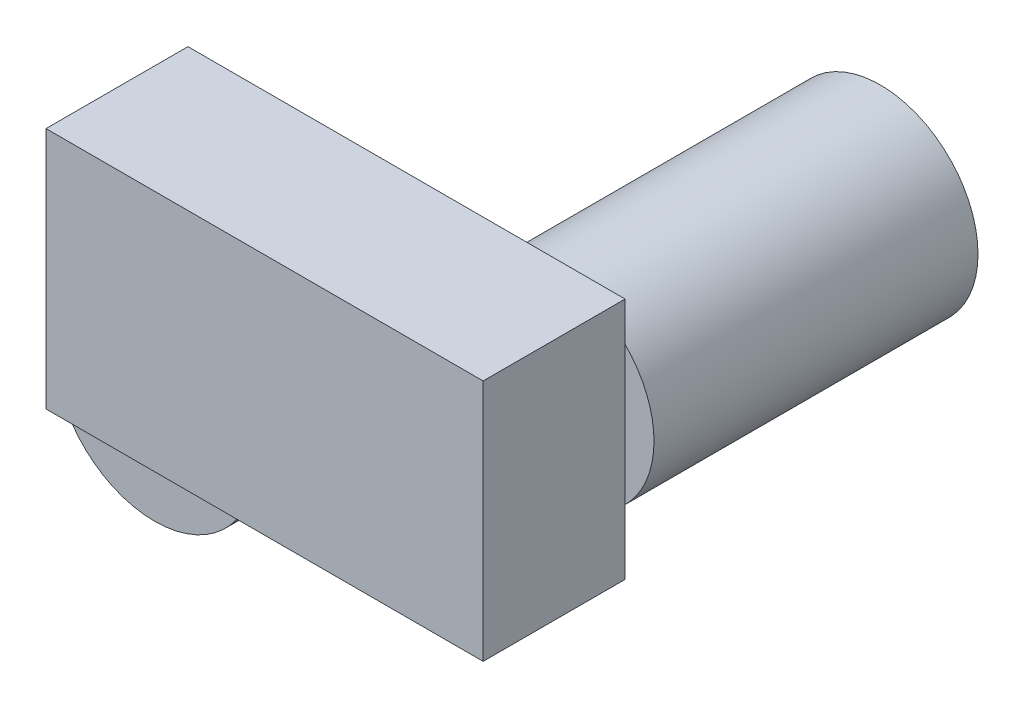
ISO-10303-21;
HEADER;
FILE_DESCRIPTION(('STEP AP214'),'2;1');
FILE_NAME('part.step','',(''),(''),'','','');
FILE_SCHEMA(('AUTOMOTIVE_DESIGN { 1 0 10303 214 1 1 1 1 }'));
ENDSEC;
DATA;
#1=APPLICATION_CONTEXT('core data for automotive mechanical design processes');
#2=APPLICATION_PROTOCOL_DEFINITION('international standard','automotive_design',2000,#1);
#3=PRODUCT_CONTEXT('',#1,'mechanical');
#4=PRODUCT('Part','Part','',(#3));
#5=PRODUCT_RELATED_PRODUCT_CATEGORY('part','',(#4));
#6=PRODUCT_DEFINITION_FORMATION('','',#4);
#7=PRODUCT_DEFINITION_CONTEXT('part definition',#1,'design');
#8=PRODUCT_DEFINITION('design','',#6,#7);
#9=PRODUCT_DEFINITION_SHAPE('','',#8);
#10=(LENGTH_UNIT() NAMED_UNIT(*) SI_UNIT(.MILLI.,.METRE.));
#11=(NAMED_UNIT(*) PLANE_ANGLE_UNIT() SI_UNIT($,.RADIAN.));
#12=(NAMED_UNIT(*) SI_UNIT($,.STERADIAN.) SOLID_ANGLE_UNIT());
#13=UNCERTAINTY_MEASURE_WITH_UNIT(LENGTH_MEASURE(1.E-05),#10,'distance_accuracy_value','');
#14=(GEOMETRIC_REPRESENTATION_CONTEXT(3) GLOBAL_UNCERTAINTY_ASSIGNED_CONTEXT((#13)) GLOBAL_UNIT_ASSIGNED_CONTEXT((#10,
#11,#12)) REPRESENTATION_CONTEXT('',''));
#15=CARTESIAN_POINT('',(0.,0.,0.));
#16=DIRECTION('',(0.,0.,1.));
#17=DIRECTION('',(1.,0.,0.));
#18=AXIS2_PLACEMENT_3D('',#15,#16,#17);
#19=CARTESIAN_POINT('',(-62.5414024105058,-7.55077319146769,0.));
#20=DIRECTION('',(0.,0.,1.));
#21=DIRECTION('',(1.,0.,0.));
#22=AXIS2_PLACEMENT_3D('',#19,#20,#21);
#23=PLANE('',#22);
#24=CARTESIAN_POINT('',(9.08017470120266,18.5374457641994,0.));
#25=DIRECTION('',(0.,0.,1.));
#26=DIRECTION('',(1.,0.,0.));
#27=AXIS2_PLACEMENT_3D('',#24,#25,#26);
#28=CIRCLE('',#27,19.);
#29=CARTESIAN_POINT('',(22.4585975894942,32.0288430610711,0.));
#30=VERTEX_POINT('',#29);
#31=CARTESIAN_POINT('',(22.4585975894942,5.04604846732777,0.));
#32=VERTEX_POINT('',#31);
#33=EDGE_CURVE('E169',#30,#32,#28,.T.);
#34=ORIENTED_EDGE('',*,*,#33,.T.);
#35=DIRECTION('',(0.,1.,0.));
#36=VECTOR('',#35,1.);
#37=CARTESIAN_POINT('',(22.4585975894942,39.669557012058,0.));
#38=LINE('',#37,#36);
#39=CARTESIAN_POINT('',(22.4585975894942,-7.55077319146769,0.));
#40=VERTEX_POINT('',#39);
#41=EDGE_CURVE('E146',#40,#32,#38,.T.);
#42=ORIENTED_EDGE('',*,*,#41,.F.);
#43=DIRECTION('',(1.,0.,0.));
#44=VECTOR('',#43,1.);
#45=CARTESIAN_POINT('',(-62.5414024105058,-7.55077319146769,0.));
#46=LINE('',#45,#44);
#47=CARTESIAN_POINT('',(-62.5414024105058,-7.55077319146769,0.));
#48=VERTEX_POINT('',#47);
#49=EDGE_CURVE('E143',#48,#40,#46,.T.);
#50=ORIENTED_EDGE('',*,*,#49,.F.);
#51=DIRECTION('',(0.,-1.,0.));
#52=VECTOR('',#51,1.);
#53=CARTESIAN_POINT('',(-62.5414024105058,39.669557012058,0.));
#54=LINE('',#53,#52);
#55=CARTESIAN_POINT('',(-62.5414024105058,39.669557012058,0.));
#56=VERTEX_POINT('',#55);
#57=EDGE_CURVE('E129',#56,#48,#54,.T.);
#58=ORIENTED_EDGE('',*,*,#57,.F.);
#59=DIRECTION('',(-1.,0.,0.));
#60=VECTOR('',#59,1.);
#61=CARTESIAN_POINT('',(-62.5414024105058,39.669557012058,0.));
#62=LINE('',#61,#60);
#63=CARTESIAN_POINT('',(22.4585975894942,39.669557012058,0.));
#64=VERTEX_POINT('',#63);
#65=EDGE_CURVE('E134',#64,#56,#62,.T.);
#66=ORIENTED_EDGE('',*,*,#65,.F.);
#67=EDGE_CURVE('E145',#30,#64,#38,.T.);
#68=ORIENTED_EDGE('',*,*,#67,.F.);
#69=EDGE_LOOP('',(#34,#42,#50,#58,#66,#68));
#70=FACE_BOUND('',#69,.T.);
#71=ADVANCED_FACE('F31',(#70),#23,.F.);
#72=CARTESIAN_POINT('',(-62.5414024105058,39.669557012058,27.6));
#73=DIRECTION('',(1.,0.,0.));
#74=DIRECTION('',(0.,0.,-1.));
#75=AXIS2_PLACEMENT_3D('',#72,#73,#74);
#76=PLANE('',#75);
#77=DIRECTION('',(0.,0.,-1.));
#78=VECTOR('',#77,1.);
#79=CARTESIAN_POINT('',(-62.5414024105058,8.5791283346381,24.));
#80=LINE('',#79,#78);
#81=CARTESIAN_POINT('',(-62.5414024105058,8.5791283346381,24.));
#82=VERTEX_POINT('',#81);
#83=CARTESIAN_POINT('',(-62.5414024105058,8.5791283346381,14.38));
#84=VERTEX_POINT('',#83);
#85=EDGE_CURVE('E46',#82,#84,#80,.T.);
#86=ORIENTED_EDGE('',*,*,#85,.F.);
#87=DIRECTION('',(0.,-1.,0.));
#88=VECTOR('',#87,1.);
#89=CARTESIAN_POINT('',(-62.5414024105058,39.669557012058,24.));
#90=LINE('',#89,#88);
#91=CARTESIAN_POINT('',(-62.5414024105058,-7.55077319146769,24.));
#92=VERTEX_POINT('',#91);
#93=EDGE_CURVE('E126',#82,#92,#90,.T.);
#94=ORIENTED_EDGE('',*,*,#93,.T.);
#95=DIRECTION('',(0.,0.,-1.));
#96=VECTOR('',#95,1.);
#97=CARTESIAN_POINT('',(-62.5414024105058,-7.55077319146769,27.6));
#98=LINE('',#97,#96);
#99=CARTESIAN_POINT('',(-62.5414024105058,-7.55077319146769,27.6));
#100=VERTEX_POINT('',#99);
#101=EDGE_CURVE('E159',#100,#92,#98,.T.);
#102=ORIENTED_EDGE('',*,*,#101,.F.);
#103=DIRECTION('',(0.,-1.,0.));
#104=VECTOR('',#103,1.);
#105=CARTESIAN_POINT('',(-62.5414024105058,39.669557012058,27.6));
#106=LINE('',#105,#104);
#107=CARTESIAN_POINT('',(-62.5414024105058,39.669557012058,27.6));
#108=VERTEX_POINT('',#107);
#109=EDGE_CURVE('E130',#108,#100,#106,.T.);
#110=ORIENTED_EDGE('',*,*,#109,.F.);
#111=DIRECTION('',(0.,0.,-1.));
#112=VECTOR('',#111,1.);
#113=CARTESIAN_POINT('',(-62.5414024105058,39.669557012058,27.6));
#114=LINE('',#113,#112);
#115=EDGE_CURVE('E140',#108,#56,#114,.T.);
#116=ORIENTED_EDGE('',*,*,#115,.T.);
#117=ORIENTED_EDGE('',*,*,#57,.T.);
#118=CARTESIAN_POINT('',(-62.5414024105058,-7.55077319146769,14.38));
#119=VERTEX_POINT('',#118);
#120=EDGE_CURVE('E158',#119,#48,#98,.T.);
#121=ORIENTED_EDGE('',*,*,#120,.F.);
#122=DIRECTION('',(0.,-1.,0.));
#123=VECTOR('',#122,1.);
#124=CARTESIAN_POINT('',(-62.5414024105058,39.669557012058,14.38));
#125=LINE('',#124,#123);
#126=EDGE_CURVE('E51',#84,#119,#125,.T.);
#127=ORIENTED_EDGE('',*,*,#126,.F.);
#128=EDGE_LOOP('',(#86,#94,#102,#110,#116,#117,#121,#127));
#129=FACE_BOUND('',#128,.T.);
#130=ADVANCED_FACE('F222',(#129),#76,.F.);
#131=CARTESIAN_POINT('',(-62.5414024105058,-7.55077319146769,27.6));
#132=DIRECTION('',(0.,1.,0.));
#133=DIRECTION('',(0.,0.,1.));
#134=AXIS2_PLACEMENT_3D('',#131,#132,#133);
#135=PLANE('',#134);
#136=ORIENTED_EDGE('',*,*,#101,.T.);
#137=DIRECTION('',(1.,0.,0.));
#138=VECTOR('',#137,1.);
#139=CARTESIAN_POINT('',(-62.5414024105058,-7.55077319146769,24.));
#140=LINE('',#139,#138);
#141=CARTESIAN_POINT('',(-27.0512584060541,-7.55077319146769,24.));
#142=VERTEX_POINT('',#141);
#143=EDGE_CURVE('E11',#92,#142,#140,.T.);
#144=ORIENTED_EDGE('',*,*,#143,.T.);
#145=DIRECTION('',(0.,0.,-1.));
#146=VECTOR('',#145,1.);
#147=CARTESIAN_POINT('',(-27.0512584060541,-7.55077319146769,24.));
#148=LINE('',#147,#146);
#149=CARTESIAN_POINT('',(-27.0512584060541,-7.55077319146769,14.38));
#150=VERTEX_POINT('',#149);
#151=EDGE_CURVE('E39',#150,#142,#148,.F.);
#152=ORIENTED_EDGE('',*,*,#151,.F.);
#153=DIRECTION('',(1.,0.,0.));
#154=VECTOR('',#153,1.);
#155=CARTESIAN_POINT('',(-62.5414024105058,-7.55077319146769,14.38));
#156=LINE('',#155,#154);
#157=EDGE_CURVE('E108',#119,#150,#156,.T.);
#158=ORIENTED_EDGE('',*,*,#157,.F.);
#159=ORIENTED_EDGE('',*,*,#120,.T.);
#160=ORIENTED_EDGE('',*,*,#49,.T.);
#161=DIRECTION('',(0.,0.,-1.));
#162=VECTOR('',#161,1.);
#163=CARTESIAN_POINT('',(22.4585975894942,-7.55077319146769,27.6));
#164=LINE('',#163,#162);
#165=CARTESIAN_POINT('',(22.4585975894942,-7.55077319146769,27.6));
#166=VERTEX_POINT('',#165);
#167=EDGE_CURVE('E155',#166,#40,#164,.T.);
#168=ORIENTED_EDGE('',*,*,#167,.F.);
#169=DIRECTION('',(1.,0.,0.));
#170=VECTOR('',#169,1.);
#171=CARTESIAN_POINT('',(-62.5414024105058,-7.55077319146769,27.6));
#172=LINE('',#171,#170);
#173=EDGE_CURVE('E133',#100,#166,#172,.T.);
#174=ORIENTED_EDGE('',*,*,#173,.F.);
#175=EDGE_LOOP('',(#136,#144,#152,#158,#159,#160,#168,#174));
#176=FACE_BOUND('',#175,.T.);
#177=ADVANCED_FACE('F107',(#176),#135,.F.);
#178=CARTESIAN_POINT('',(22.4585975894942,39.669557012058,27.6));
#179=DIRECTION('',(-1.,0.,0.));
#180=DIRECTION('',(0.,-1.,0.));
#181=AXIS2_PLACEMENT_3D('',#178,#179,#180);
#182=PLANE('',#181);
#183=ORIENTED_EDGE('',*,*,#41,.T.);
#184=EDGE_CURVE('E148',#32,#30,#38,.T.);
#185=ORIENTED_EDGE('',*,*,#184,.T.);
#186=ORIENTED_EDGE('',*,*,#67,.T.);
#187=DIRECTION('',(0.,0.,-1.));
#188=VECTOR('',#187,1.);
#189=CARTESIAN_POINT('',(22.4585975894942,39.669557012058,27.6));
#190=LINE('',#189,#188);
#191=CARTESIAN_POINT('',(22.4585975894942,39.669557012058,27.6));
#192=VERTEX_POINT('',#191);
#193=EDGE_CURVE('E152',#192,#64,#190,.T.);
#194=ORIENTED_EDGE('',*,*,#193,.F.);
#195=DIRECTION('',(0.,1.,0.));
#196=VECTOR('',#195,1.);
#197=CARTESIAN_POINT('',(22.4585975894942,39.669557012058,27.6));
#198=LINE('',#197,#196);
#199=EDGE_CURVE('E136',#166,#192,#198,.T.);
#200=ORIENTED_EDGE('',*,*,#199,.F.);
#201=ORIENTED_EDGE('',*,*,#167,.T.);
#202=EDGE_LOOP('',(#183,#185,#186,#194,#200,#201));
#203=FACE_BOUND('',#202,.T.);
#204=ADVANCED_FACE('F215',(#203),#182,.F.);
#205=CARTESIAN_POINT('',(-62.5414024105058,39.669557012058,27.6));
#206=DIRECTION('',(0.,-1.,0.));
#207=DIRECTION('',(0.,0.,-1.));
#208=AXIS2_PLACEMENT_3D('',#205,#206,#207);
#209=PLANE('',#208);
#210=ORIENTED_EDGE('',*,*,#65,.T.);
#211=ORIENTED_EDGE('',*,*,#115,.F.);
#212=DIRECTION('',(-1.,0.,0.));
#213=VECTOR('',#212,1.);
#214=CARTESIAN_POINT('',(-62.5414024105058,39.669557012058,27.6));
#215=LINE('',#214,#213);
#216=EDGE_CURVE('E138',#192,#108,#215,.T.);
#217=ORIENTED_EDGE('',*,*,#216,.F.);
#218=ORIENTED_EDGE('',*,*,#193,.T.);
#219=EDGE_LOOP('',(#210,#211,#217,#218));
#220=FACE_BOUND('',#219,.T.);
#221=ADVANCED_FACE('F219',(#220),#209,.F.);
#222=CARTESIAN_POINT('',(-62.5414024105058,-7.55077319146769,27.6));
#223=DIRECTION('',(0.,0.,1.));
#224=DIRECTION('',(1.,0.,0.));
#225=AXIS2_PLACEMENT_3D('',#222,#223,#224);
#226=PLANE('',#225);
#227=ORIENTED_EDGE('',*,*,#109,.T.);
#228=ORIENTED_EDGE('',*,*,#173,.T.);
#229=ORIENTED_EDGE('',*,*,#199,.T.);
#230=ORIENTED_EDGE('',*,*,#216,.T.);
#231=EDGE_LOOP('',(#227,#228,#229,#230));
#232=FACE_BOUND('',#231,.T.);
#233=ADVANCED_FACE('F226',(#232),#226,.T.);
#234=CARTESIAN_POINT('',(-21.1862419644348,17.1813946890512,-63.));
#235=DIRECTION('',(0.,0.,1.));
#236=DIRECTION('',(1.,0.,0.));
#237=AXIS2_PLACEMENT_3D('',#234,#235,#236);
#238=CYLINDRICAL_SURFACE('',#237,21.15);
#239=CARTESIAN_POINT('',(-21.1862419644348,17.1813946890512,0.));
#240=DIRECTION('',(0.,0.,1.));
#241=DIRECTION('',(1.,0.,0.));
#242=AXIS2_PLACEMENT_3D('',#239,#240,#241);
#243=CIRCLE('',#242,21.15);
#244=CARTESIAN_POINT('',(-0.140259901825004,19.2764219013581,0.));
#245=VERTEX_POINT('',#244);
#246=CARTESIAN_POINT('',(-0.0372309394255036,16.9768643391397,0.));
#247=VERTEX_POINT('',#246);
#248=EDGE_CURVE('E161',#245,#247,#243,.F.);
#249=ORIENTED_EDGE('',*,*,#248,.F.);
#250=DIRECTION('',(0.,0.,1.));
#251=VECTOR('',#250,1.);
#252=CARTESIAN_POINT('',(-0.140259901825004,19.2764219013581,-63.));
#253=LINE('',#252,#251);
#254=CARTESIAN_POINT('',(-0.140259901825004,19.2764219013581,-63.));
#255=VERTEX_POINT('',#254);
#256=EDGE_CURVE('E174',#255,#245,#253,.T.);
#257=ORIENTED_EDGE('',*,*,#256,.F.);
#258=CARTESIAN_POINT('',(-21.1862419644348,17.1813946890512,-63.));
#259=DIRECTION('',(0.,0.,1.));
#260=DIRECTION('',(1.,0.,0.));
#261=AXIS2_PLACEMENT_3D('',#258,#259,#260);
#262=CIRCLE('',#261,21.15);
#263=CARTESIAN_POINT('',(-0.0372309394255019,16.9768643391397,-63.));
#264=VERTEX_POINT('',#263);
#265=EDGE_CURVE('E168',#264,#255,#262,.T.);
#266=ORIENTED_EDGE('',*,*,#265,.F.);
#267=DIRECTION('',(0.,0.,1.));
#268=VECTOR('',#267,1.);
#269=CARTESIAN_POINT('',(-0.0372309394255019,16.9768643391397,-63.));
#270=LINE('',#269,#268);
#271=EDGE_CURVE('E118',#264,#247,#270,.T.);
#272=ORIENTED_EDGE('',*,*,#271,.T.);
#273=EDGE_LOOP('',(#249,#257,#266,#272));
#274=FACE_BOUND('',#273,.T.);
#275=ADVANCED_FACE('F190',(#274),#238,.F.);
#276=CARTESIAN_POINT('',(-19.9295775037876,-71.9989985881213,0.));
#277=DIRECTION('',(0.,0.,1.));
#278=DIRECTION('',(1.,0.,0.));
#279=AXIS2_PLACEMENT_3D('',#276,#277,#278);
#280=PLANE('',#279);
#281=EDGE_CURVE('E176',#32,#30,#28,.T.);
#282=ORIENTED_EDGE('',*,*,#281,.T.);
#283=ORIENTED_EDGE('',*,*,#184,.F.);
#284=EDGE_LOOP('',(#282,#283));
#285=FACE_BOUND('',#284,.T.);
#286=ADVANCED_FACE('F212',(#285),#280,.T.);
#287=CARTESIAN_POINT('',(9.08017470120266,18.5374457641994,-63.));
#288=DIRECTION('',(0.,0.,1.));
#289=DIRECTION('',(1.,0.,0.));
#290=AXIS2_PLACEMENT_3D('',#287,#288,#289);
#291=CYLINDRICAL_SURFACE('',#290,9.24999999999999);
#292=CARTESIAN_POINT('',(9.08017470120266,18.5374457641994,0.));
#293=DIRECTION('',(0.,0.,1.));
#294=DIRECTION('',(1.,0.,0.));
#295=AXIS2_PLACEMENT_3D('',#292,#293,#294);
#296=CIRCLE('',#295,9.24999999999999);
#297=EDGE_CURVE('E164',#245,#247,#296,.T.);
#298=ORIENTED_EDGE('',*,*,#297,.T.);
#299=ORIENTED_EDGE('',*,*,#271,.F.);
#300=CARTESIAN_POINT('',(9.08017470120266,18.5374457641994,-63.));
#301=DIRECTION('',(0.,0.,1.));
#302=DIRECTION('',(1.,0.,0.));
#303=AXIS2_PLACEMENT_3D('',#300,#301,#302);
#304=CIRCLE('',#303,9.24999999999999);
#305=EDGE_CURVE('E165',#255,#264,#304,.T.);
#306=ORIENTED_EDGE('',*,*,#305,.F.);
#307=ORIENTED_EDGE('',*,*,#256,.T.);
#308=EDGE_LOOP('',(#298,#299,#306,#307));
#309=FACE_BOUND('',#308,.T.);
#310=ADVANCED_FACE('F33',(#309),#291,.F.);
#311=CARTESIAN_POINT('',(9.08017470120266,18.5374457641994,-63.));
#312=DIRECTION('',(0.,0.,1.));
#313=DIRECTION('',(1.,0.,0.));
#314=AXIS2_PLACEMENT_3D('',#311,#312,#313);
#315=CYLINDRICAL_SURFACE('',#314,19.);
#316=CARTESIAN_POINT('',(9.08017470120266,18.5374457641994,-63.));
#317=DIRECTION('',(0.,0.,1.));
#318=DIRECTION('',(1.,0.,0.));
#319=AXIS2_PLACEMENT_3D('',#316,#317,#318);
#320=CIRCLE('',#319,19.);
#321=CARTESIAN_POINT('',(28.0801747012027,18.5374457641994,-63.));
#322=VERTEX_POINT('',#321);
#323=EDGE_CURVE('E171',#322,#322,#320,.T.);
#324=ORIENTED_EDGE('',*,*,#323,.T.);
#325=EDGE_LOOP('',(#324));
#326=FACE_BOUND('',#325,.T.);
#327=ORIENTED_EDGE('',*,*,#33,.F.);
#328=ORIENTED_EDGE('',*,*,#281,.F.);
#329=EDGE_LOOP('',(#327,#328));
#330=FACE_BOUND('',#329,.T.);
#331=ADVANCED_FACE('F195',(#326,#330),#315,.T.);
#332=CARTESIAN_POINT('',(-19.9295775037876,-71.9989985881213,-63.));
#333=DIRECTION('',(0.,0.,1.));
#334=DIRECTION('',(1.,0.,0.));
#335=AXIS2_PLACEMENT_3D('',#332,#333,#334);
#336=PLANE('',#335);
#337=ORIENTED_EDGE('',*,*,#305,.T.);
#338=ORIENTED_EDGE('',*,*,#265,.T.);
#339=EDGE_LOOP('',(#337,#338));
#340=FACE_BOUND('',#339,.T.);
#341=ORIENTED_EDGE('',*,*,#323,.F.);
#342=EDGE_LOOP('',(#341));
#343=FACE_BOUND('',#342,.T.);
#344=ADVANCED_FACE('F192',(#340,#343),#336,.F.);
#345=ORIENTED_EDGE('',*,*,#248,.T.);
#346=ORIENTED_EDGE('',*,*,#297,.F.);
#347=EDGE_LOOP('',(#345,#346));
#348=FACE_BOUND('',#347,.T.);
#349=ADVANCED_FACE('F189',(#348),#23,.F.);
#350=CARTESIAN_POINT('',(-45.0300187696335,0.,24.));
#351=DIRECTION('',(0.,0.,-1.));
#352=DIRECTION('',(-1.,0.,0.));
#353=AXIS2_PLACEMENT_3D('',#350,#351,#352);
#354=CYLINDRICAL_SURFACE('',#353,19.5);
#355=CARTESIAN_POINT('',(-45.0300187696335,0.,24.));
#356=DIRECTION('',(0.,0.,1.));
#357=DIRECTION('',(1.,0.,0.));
#358=AXIS2_PLACEMENT_3D('',#355,#356,#357);
#359=CIRCLE('',#358,19.5);
#360=EDGE_CURVE('E121',#82,#142,#359,.T.);
#361=ORIENTED_EDGE('',*,*,#360,.F.);
#362=ORIENTED_EDGE('',*,*,#85,.T.);
#363=CARTESIAN_POINT('',(-45.0300187696335,0.,14.38));
#364=DIRECTION('',(0.,0.,1.));
#365=DIRECTION('',(1.,0.,0.));
#366=AXIS2_PLACEMENT_3D('',#363,#364,#365);
#367=CIRCLE('',#366,19.5);
#368=EDGE_CURVE('E117',#84,#150,#367,.T.);
#369=ORIENTED_EDGE('',*,*,#368,.T.);
#370=ORIENTED_EDGE('',*,*,#151,.T.);
#371=EDGE_LOOP('',(#361,#362,#369,#370));
#372=FACE_BOUND('',#371,.T.);
#373=ADVANCED_FACE('F120',(#372),#354,.T.);
#374=CARTESIAN_POINT('',(-32.0387692987252,-58.7947184610287,24.));
#375=DIRECTION('',(0.,0.,1.));
#376=DIRECTION('',(1.,0.,0.));
#377=AXIS2_PLACEMENT_3D('',#374,#375,#376);
#378=PLANE('',#377);
#379=ORIENTED_EDGE('',*,*,#93,.F.);
#380=ORIENTED_EDGE('',*,*,#360,.T.);
#381=ORIENTED_EDGE('',*,*,#143,.F.);
#382=EDGE_LOOP('',(#379,#380,#381));
#383=FACE_BOUND('',#382,.T.);
#384=ADVANCED_FACE('F229',(#383),#378,.T.);
#385=CARTESIAN_POINT('',(-32.0387692987252,-58.7947184610287,14.38));
#386=DIRECTION('',(0.,0.,1.));
#387=DIRECTION('',(1.,0.,0.));
#388=AXIS2_PLACEMENT_3D('',#385,#386,#387);
#389=PLANE('',#388);
#390=ORIENTED_EDGE('',*,*,#368,.F.);
#391=ORIENTED_EDGE('',*,*,#126,.T.);
#392=ORIENTED_EDGE('',*,*,#157,.T.);
#393=EDGE_LOOP('',(#390,#391,#392));
#394=FACE_BOUND('',#393,.T.);
#395=ADVANCED_FACE('F116',(#394),#389,.F.);
#396=CLOSED_SHELL('',(#71,#130,#177,#204,#221,#233,#275,#286,#310,#331,#344,#349,#373,#384,#395));
#397=MANIFOLD_SOLID_BREP('B2',#396);
#398=ADVANCED_BREP_SHAPE_REPRESENTATION('',(#18,#397),#14);
#399=SHAPE_DEFINITION_REPRESENTATION(#9,#398);
ENDSEC;
END-ISO-10303-21;
